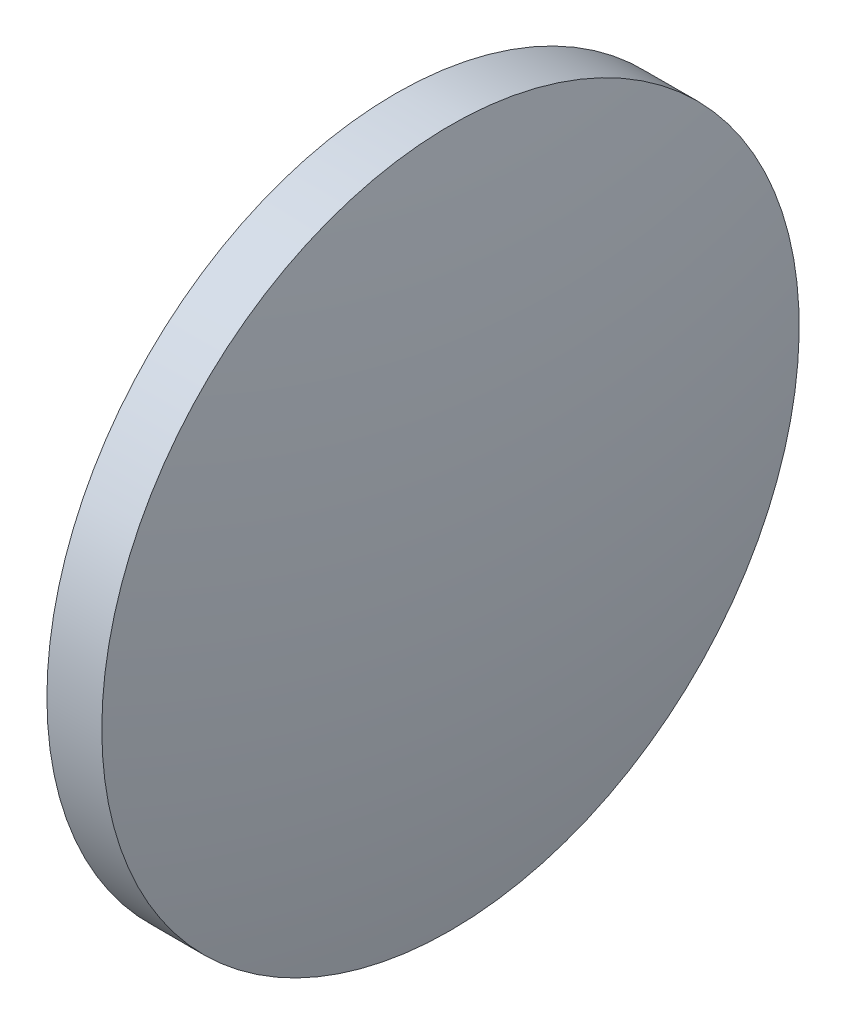
ISO-10303-21;
HEADER;
FILE_DESCRIPTION(('STEP AP214'),'2;1');
FILE_NAME('part.step','',(''),(''),'','','');
FILE_SCHEMA(('AUTOMOTIVE_DESIGN { 1 0 10303 214 1 1 1 1 }'));
ENDSEC;
DATA;
#1=APPLICATION_CONTEXT('core data for automotive mechanical design processes');
#2=APPLICATION_PROTOCOL_DEFINITION('international standard','automotive_design',2000,#1);
#3=PRODUCT_CONTEXT('',#1,'mechanical');
#4=PRODUCT('Part','Part','',(#3));
#5=PRODUCT_RELATED_PRODUCT_CATEGORY('part','',(#4));
#6=PRODUCT_DEFINITION_FORMATION('','',#4);
#7=PRODUCT_DEFINITION_CONTEXT('part definition',#1,'design');
#8=PRODUCT_DEFINITION('design','',#6,#7);
#9=PRODUCT_DEFINITION_SHAPE('','',#8);
#10=(LENGTH_UNIT() NAMED_UNIT(*) SI_UNIT(.MILLI.,.METRE.));
#11=(NAMED_UNIT(*) PLANE_ANGLE_UNIT() SI_UNIT($,.RADIAN.));
#12=(NAMED_UNIT(*) SI_UNIT($,.STERADIAN.) SOLID_ANGLE_UNIT());
#13=UNCERTAINTY_MEASURE_WITH_UNIT(LENGTH_MEASURE(1.E-05),#10,'distance_accuracy_value','');
#14=(GEOMETRIC_REPRESENTATION_CONTEXT(3) GLOBAL_UNCERTAINTY_ASSIGNED_CONTEXT((#13)) GLOBAL_UNIT_ASSIGNED_CONTEXT((#10,
#11,#12)) REPRESENTATION_CONTEXT('',''));
#15=CARTESIAN_POINT('',(0.,0.,0.));
#16=DIRECTION('',(0.,0.,1.));
#17=DIRECTION('',(1.,0.,0.));
#18=AXIS2_PLACEMENT_3D('',#15,#16,#17);
#19=CARTESIAN_POINT('',(149.347289016214,48.6161130231847,0.));
#20=DIRECTION('',(-1.,0.,0.));
#21=DIRECTION('',(0.,1.,0.));
#22=AXIS2_PLACEMENT_3D('',#19,#20,#21);
#23=SPHERICAL_SURFACE('',#22,65.1388095272657);
#24=CARTESIAN_POINT('',(85.4585223460911,48.6161130231848,0.));
#25=DIRECTION('',(-1.,0.,0.));
#26=DIRECTION('',(0.,0.,1.));
#27=AXIS2_PLACEMENT_3D('',#24,#25,#26);
#28=CIRCLE('',#27,12.7);
#29=CARTESIAN_POINT('',(85.4585223460911,48.6161130231848,12.7));
#30=VERTEX_POINT('',#29);
#31=EDGE_CURVE('E41',#30,#30,#28,.T.);
#32=ORIENTED_EDGE('',*,*,#31,.T.);
#33=EDGE_LOOP('',(#32));
#34=FACE_BOUND('',#33,.T.);
#35=ADVANCED_FACE('F35',(#34),#23,.T.);
#36=CARTESIAN_POINT('',(23.569098533112,48.6161130231848,0.));
#37=DIRECTION('',(-1.,0.,0.));
#38=DIRECTION('',(0.,-1.,0.));
#39=AXIS2_PLACEMENT_3D('',#36,#37,#38);
#40=SPHERICAL_SURFACE('',#39,65.1388095272648);
#41=CARTESIAN_POINT('',(87.457865203234,48.6161130231848,0.));
#42=DIRECTION('',(-1.,0.,0.));
#43=DIRECTION('',(0.,0.,1.));
#44=AXIS2_PLACEMENT_3D('',#41,#42,#43);
#45=CIRCLE('',#44,12.7);
#46=CARTESIAN_POINT('',(87.457865203234,48.6161130231848,12.7));
#47=VERTEX_POINT('',#46);
#48=EDGE_CURVE('E10',#47,#47,#45,.T.);
#49=ORIENTED_EDGE('',*,*,#48,.F.);
#50=EDGE_LOOP('',(#49));
#51=FACE_BOUND('',#50,.T.);
#52=ADVANCED_FACE('F50',(#51),#40,.T.);
#53=CARTESIAN_POINT('',(79.3054013508372,48.6161130231848,0.));
#54=DIRECTION('',(-1.,0.,0.));
#55=DIRECTION('',(0.,0.,1.));
#56=AXIS2_PLACEMENT_3D('',#53,#54,#55);
#57=CYLINDRICAL_SURFACE('',#56,12.7);
#58=ORIENTED_EDGE('',*,*,#48,.T.);
#59=EDGE_LOOP('',(#58));
#60=FACE_BOUND('',#59,.T.);
#61=ORIENTED_EDGE('',*,*,#31,.F.);
#62=EDGE_LOOP('',(#61));
#63=FACE_BOUND('',#62,.T.);
#64=ADVANCED_FACE('F48',(#60,#63),#57,.T.);
#65=CLOSED_SHELL('',(#35,#52,#64));
#66=MANIFOLD_SOLID_BREP('B2',#65);
#67=ADVANCED_BREP_SHAPE_REPRESENTATION('',(#18,#66),#14);
#68=SHAPE_DEFINITION_REPRESENTATION(#9,#67);
ENDSEC;
END-ISO-10303-21;
